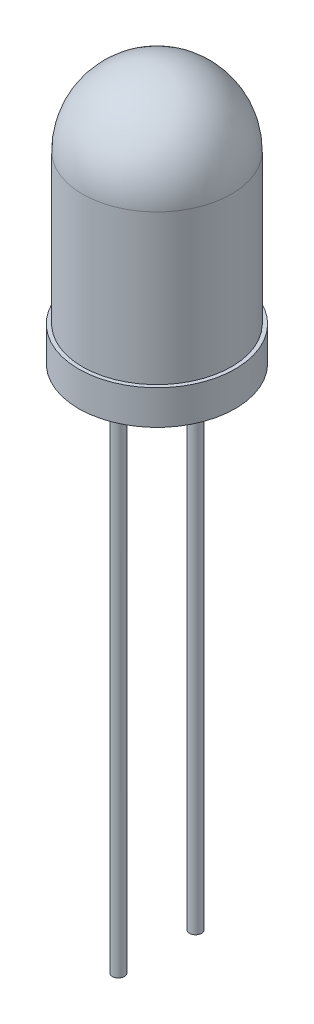
ISO-10303-21;
HEADER;
FILE_DESCRIPTION(('STEP AP214'),'2;1');
FILE_NAME('part.step','',(''),(''),'','','');
FILE_SCHEMA(('AUTOMOTIVE_DESIGN { 1 0 10303 214 1 1 1 1 }'));
ENDSEC;
DATA;
#1=APPLICATION_CONTEXT('core data for automotive mechanical design processes');
#2=APPLICATION_PROTOCOL_DEFINITION('international standard','automotive_design',2000,#1);
#3=PRODUCT_CONTEXT('',#1,'mechanical');
#4=PRODUCT('Part','Part','',(#3));
#5=PRODUCT_RELATED_PRODUCT_CATEGORY('part','',(#4));
#6=PRODUCT_DEFINITION_FORMATION('','',#4);
#7=PRODUCT_DEFINITION_CONTEXT('part definition',#1,'design');
#8=PRODUCT_DEFINITION('design','',#6,#7);
#9=PRODUCT_DEFINITION_SHAPE('','',#8);
#10=(LENGTH_UNIT() NAMED_UNIT(*) SI_UNIT(.MILLI.,.METRE.));
#11=(NAMED_UNIT(*) PLANE_ANGLE_UNIT() SI_UNIT($,.RADIAN.));
#12=(NAMED_UNIT(*) SI_UNIT($,.STERADIAN.) SOLID_ANGLE_UNIT());
#13=UNCERTAINTY_MEASURE_WITH_UNIT(LENGTH_MEASURE(1.E-05),#10,'distance_accuracy_value','');
#14=(GEOMETRIC_REPRESENTATION_CONTEXT(3) GLOBAL_UNCERTAINTY_ASSIGNED_CONTEXT((#13)) GLOBAL_UNIT_ASSIGNED_CONTEXT((#10,
#11,#12)) REPRESENTATION_CONTEXT('',''));
#15=CARTESIAN_POINT('',(0.,0.,0.));
#16=DIRECTION('',(0.,0.,1.));
#17=DIRECTION('',(1.,0.,0.));
#18=AXIS2_PLACEMENT_3D('',#15,#16,#17);
#19=CARTESIAN_POINT('',(1.27,-18.,0.));
#20=DIRECTION('',(0.,1.,0.));
#21=DIRECTION('',(0.,0.,1.));
#22=AXIS2_PLACEMENT_3D('',#19,#20,#21);
#23=CYLINDRICAL_SURFACE('',#22,0.2);
#24=CARTESIAN_POINT('',(1.27,0.,0.));
#25=DIRECTION('',(0.,1.,0.));
#26=DIRECTION('',(0.,0.,1.));
#27=AXIS2_PLACEMENT_3D('',#24,#25,#26);
#28=CIRCLE('',#27,0.2);
#29=CARTESIAN_POINT('',(1.27,0.,0.2));
#30=VERTEX_POINT('',#29);
#31=EDGE_CURVE('E10',#30,#30,#28,.F.);
#32=ORIENTED_EDGE('',*,*,#31,.T.);
#33=EDGE_LOOP('',(#32));
#34=FACE_BOUND('',#33,.T.);
#35=CARTESIAN_POINT('',(1.27,-15.5,0.));
#36=DIRECTION('',(0.,-1.,0.));
#37=DIRECTION('',(0.,0.,-1.));
#38=AXIS2_PLACEMENT_3D('',#35,#36,#37);
#39=CIRCLE('',#38,0.2);
#40=CARTESIAN_POINT('',(1.27,-15.5,-0.2));
#41=VERTEX_POINT('',#40);
#42=EDGE_CURVE('E53',#41,#41,#39,.T.);
#43=ORIENTED_EDGE('',*,*,#42,.F.);
#44=EDGE_LOOP('',(#43));
#45=FACE_BOUND('',#44,.T.);
#46=ADVANCED_FACE('F49',(#34,#45),#23,.T.);
#47=CARTESIAN_POINT('',(0.,8.5,0.));
#48=DIRECTION('',(0.,-1.,0.));
#49=DIRECTION('',(0.,0.,-1.));
#50=AXIS2_PLACEMENT_3D('',#47,#48,#49);
#51=CYLINDRICAL_SURFACE('',#50,2.575);
#52=CARTESIAN_POINT('',(0.,0.,0.));
#53=DIRECTION('',(0.,1.,0.));
#54=DIRECTION('',(0.,0.,1.));
#55=AXIS2_PLACEMENT_3D('',#52,#53,#54);
#56=CIRCLE('',#55,2.575);
#57=CARTESIAN_POINT('',(0.,0.,2.575));
#58=VERTEX_POINT('',#57);
#59=EDGE_CURVE('E69',#58,#58,#56,.T.);
#60=ORIENTED_EDGE('',*,*,#59,.T.);
#61=EDGE_LOOP('',(#60));
#62=FACE_BOUND('',#61,.T.);
#63=CARTESIAN_POINT('',(0.,1.13,0.));
#64=DIRECTION('',(0.,1.,0.));
#65=DIRECTION('',(0.,0.,1.));
#66=AXIS2_PLACEMENT_3D('',#63,#64,#65);
#67=CIRCLE('',#66,2.575);
#68=CARTESIAN_POINT('',(0.,1.13,2.575));
#69=VERTEX_POINT('',#68);
#70=EDGE_CURVE('E73',#69,#69,#67,.T.);
#71=ORIENTED_EDGE('',*,*,#70,.F.);
#72=EDGE_LOOP('',(#71));
#73=FACE_BOUND('',#72,.T.);
#74=ADVANCED_FACE('F93',(#62,#73),#51,.T.);
#75=CARTESIAN_POINT('',(0.,0.,0.));
#76=DIRECTION('',(0.,1.,0.));
#77=DIRECTION('',(0.,0.,1.));
#78=AXIS2_PLACEMENT_3D('',#75,#76,#77);
#79=PLANE('',#78);
#80=ORIENTED_EDGE('',*,*,#31,.F.);
#81=EDGE_LOOP('',(#80));
#82=FACE_BOUND('',#81,.T.);
#83=CARTESIAN_POINT('',(-1.27,0.,0.));
#84=DIRECTION('',(0.,1.,0.));
#85=DIRECTION('',(0.,0.,1.));
#86=AXIS2_PLACEMENT_3D('',#83,#84,#85);
#87=CIRCLE('',#86,0.2);
#88=CARTESIAN_POINT('',(-1.27,0.,0.2));
#89=VERTEX_POINT('',#88);
#90=EDGE_CURVE('E58',#89,#89,#87,.F.);
#91=ORIENTED_EDGE('',*,*,#90,.F.);
#92=EDGE_LOOP('',(#91));
#93=FACE_BOUND('',#92,.T.);
#94=ORIENTED_EDGE('',*,*,#59,.F.);
#95=EDGE_LOOP('',(#94));
#96=FACE_BOUND('',#95,.T.);
#97=ADVANCED_FACE('F100',(#82,#93,#96),#79,.F.);
#98=CARTESIAN_POINT('',(0.,1.13,0.));
#99=DIRECTION('',(0.,1.,0.));
#100=DIRECTION('',(0.,0.,1.));
#101=AXIS2_PLACEMENT_3D('',#98,#99,#100);
#102=PLANE('',#101);
#103=CARTESIAN_POINT('',(0.,1.13,0.));
#104=DIRECTION('',(0.,1.,0.));
#105=DIRECTION('',(0.,0.,1.));
#106=AXIS2_PLACEMENT_3D('',#103,#104,#105);
#107=CIRCLE('',#106,2.45);
#108=CARTESIAN_POINT('',(0.,1.13,2.45));
#109=VERTEX_POINT('',#108);
#110=EDGE_CURVE('E77',#109,#109,#107,.T.);
#111=ORIENTED_EDGE('',*,*,#110,.F.);
#112=EDGE_LOOP('',(#111));
#113=FACE_BOUND('',#112,.T.);
#114=ORIENTED_EDGE('',*,*,#70,.T.);
#115=EDGE_LOOP('',(#114));
#116=FACE_BOUND('',#115,.T.);
#117=ADVANCED_FACE('F113',(#113,#116),#102,.T.);
#118=CARTESIAN_POINT('',(0.,1.13,0.));
#119=DIRECTION('',(0.,1.,0.));
#120=DIRECTION('',(0.,0.,1.));
#121=AXIS2_PLACEMENT_3D('',#118,#119,#120);
#122=CYLINDRICAL_SURFACE('',#121,2.45);
#123=CARTESIAN_POINT('',(0.,6.05,0.));
#124=DIRECTION('',(0.,1.,0.));
#125=DIRECTION('',(0.,0.,1.));
#126=AXIS2_PLACEMENT_3D('',#123,#124,#125);
#127=CIRCLE('',#126,2.45);
#128=CARTESIAN_POINT('',(0.,6.05,2.45));
#129=VERTEX_POINT('',#128);
#130=EDGE_CURVE('E63',#129,#129,#127,.F.);
#131=ORIENTED_EDGE('',*,*,#130,.T.);
#132=EDGE_LOOP('',(#131));
#133=FACE_BOUND('',#132,.T.);
#134=ORIENTED_EDGE('',*,*,#110,.T.);
#135=EDGE_LOOP('',(#134));
#136=FACE_BOUND('',#135,.T.);
#137=ADVANCED_FACE('F110',(#133,#136),#122,.T.);
#138=CARTESIAN_POINT('',(0.,6.05,0.));
#139=DIRECTION('',(0.,1.,0.));
#140=DIRECTION('',(0.,0.,1.));
#141=AXIS2_PLACEMENT_3D('',#138,#139,#140);
#142=SPHERICAL_SURFACE('',#141,2.45);
#143=ORIENTED_EDGE('',*,*,#130,.F.);
#144=EDGE_LOOP('',(#143));
#145=FACE_BOUND('',#144,.T.);
#146=ADVANCED_FACE('F51',(#145),#142,.T.);
#147=CARTESIAN_POINT('',(-1.27,-18.,0.));
#148=DIRECTION('',(0.,1.,0.));
#149=DIRECTION('',(0.,0.,1.));
#150=AXIS2_PLACEMENT_3D('',#147,#148,#149);
#151=CYLINDRICAL_SURFACE('',#150,0.2);
#152=CARTESIAN_POINT('',(-1.27,-18.,0.));
#153=DIRECTION('',(0.,-1.,0.));
#154=DIRECTION('',(0.,0.,-1.));
#155=AXIS2_PLACEMENT_3D('',#152,#153,#154);
#156=CIRCLE('',#155,0.2);
#157=CARTESIAN_POINT('',(-1.27,-18.,-0.2));
#158=VERTEX_POINT('',#157);
#159=EDGE_CURVE('E81',#158,#158,#156,.T.);
#160=ORIENTED_EDGE('',*,*,#159,.F.);
#161=EDGE_LOOP('',(#160));
#162=FACE_BOUND('',#161,.T.);
#163=ORIENTED_EDGE('',*,*,#90,.T.);
#164=EDGE_LOOP('',(#163));
#165=FACE_BOUND('',#164,.T.);
#166=ADVANCED_FACE('F106',(#162,#165),#151,.T.);
#167=CARTESIAN_POINT('',(-1.27,-18.,0.));
#168=DIRECTION('',(0.,-1.,0.));
#169=DIRECTION('',(0.,0.,-1.));
#170=AXIS2_PLACEMENT_3D('',#167,#168,#169);
#171=PLANE('',#170);
#172=ORIENTED_EDGE('',*,*,#159,.T.);
#173=EDGE_LOOP('',(#172));
#174=FACE_BOUND('',#173,.T.);
#175=ADVANCED_FACE('F104',(#174),#171,.T.);
#176=CARTESIAN_POINT('',(1.27,-15.5,0.));
#177=DIRECTION('',(0.,-1.,0.));
#178=DIRECTION('',(0.,0.,-1.));
#179=AXIS2_PLACEMENT_3D('',#176,#177,#178);
#180=PLANE('',#179);
#181=ORIENTED_EDGE('',*,*,#42,.T.);
#182=EDGE_LOOP('',(#181));
#183=FACE_BOUND('',#182,.T.);
#184=ADVANCED_FACE('F90',(#183),#180,.T.);
#185=CLOSED_SHELL('',(#46,#74,#97,#117,#137,#146,#166,#175,#184));
#186=MANIFOLD_SOLID_BREP('B2',#185);
#187=ADVANCED_BREP_SHAPE_REPRESENTATION('',(#18,#186),#14);
#188=SHAPE_DEFINITION_REPRESENTATION(#9,#187);
ENDSEC;
END-ISO-10303-21;
